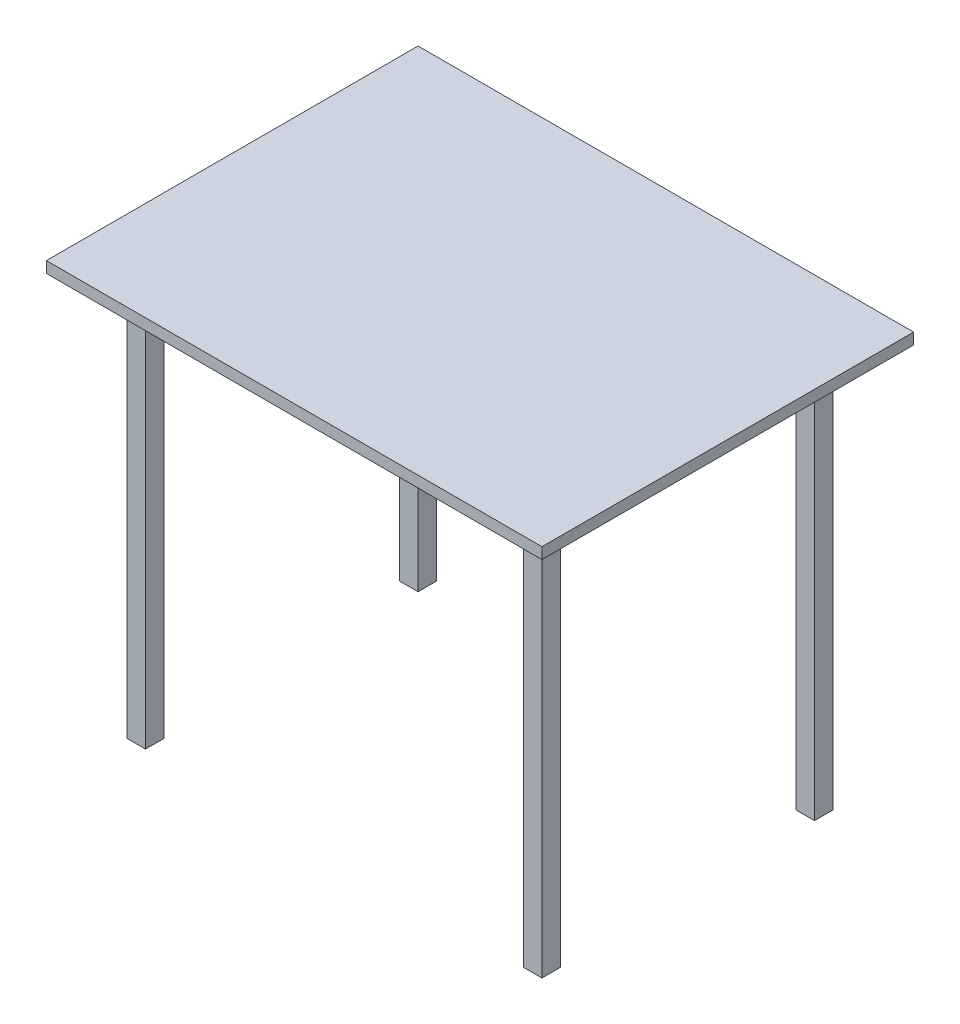
ISO-10303-21;
HEADER;
FILE_DESCRIPTION(('STEP AP214'),'2;1');
FILE_NAME('part.step','',(''),(''),'','','');
FILE_SCHEMA(('AUTOMOTIVE_DESIGN { 1 0 10303 214 1 1 1 1 }'));
ENDSEC;
DATA;
#1=APPLICATION_CONTEXT('core data for automotive mechanical design processes');
#2=APPLICATION_PROTOCOL_DEFINITION('international standard','automotive_design',2000,#1);
#3=PRODUCT_CONTEXT('',#1,'mechanical');
#4=PRODUCT('Part','Part','',(#3));
#5=PRODUCT_RELATED_PRODUCT_CATEGORY('part','',(#4));
#6=PRODUCT_DEFINITION_FORMATION('','',#4);
#7=PRODUCT_DEFINITION_CONTEXT('part definition',#1,'design');
#8=PRODUCT_DEFINITION('design','',#6,#7);
#9=PRODUCT_DEFINITION_SHAPE('','',#8);
#10=(LENGTH_UNIT() NAMED_UNIT(*) SI_UNIT(.MILLI.,.METRE.));
#11=(NAMED_UNIT(*) PLANE_ANGLE_UNIT() SI_UNIT($,.RADIAN.));
#12=(NAMED_UNIT(*) SI_UNIT($,.STERADIAN.) SOLID_ANGLE_UNIT());
#13=UNCERTAINTY_MEASURE_WITH_UNIT(LENGTH_MEASURE(1.E-05),#10,'distance_accuracy_value','');
#14=(GEOMETRIC_REPRESENTATION_CONTEXT(3) GLOBAL_UNCERTAINTY_ASSIGNED_CONTEXT((#13)) GLOBAL_UNIT_ASSIGNED_CONTEXT((#10,
#11,#12)) REPRESENTATION_CONTEXT('',''));
#15=CARTESIAN_POINT('',(0.,0.,0.));
#16=DIRECTION('',(0.,0.,1.));
#17=DIRECTION('',(1.,0.,0.));
#18=AXIS2_PLACEMENT_3D('',#15,#16,#17);
#19=CARTESIAN_POINT('',(0.,0.,0.));
#20=DIRECTION('',(0.,1.,0.));
#21=DIRECTION('',(0.,0.,1.));
#22=AXIS2_PLACEMENT_3D('',#19,#20,#21);
#23=PLANE('',#22);
#24=DIRECTION('',(0.,0.,-1.));
#25=VECTOR('',#24,1.);
#26=CARTESIAN_POINT('',(305.,0.,-205.));
#27=LINE('',#26,#25);
#28=CARTESIAN_POINT('',(305.,0.,-205.));
#29=VERTEX_POINT('',#28);
#30=CARTESIAN_POINT('',(305.,0.,-235.));
#31=VERTEX_POINT('',#30);
#32=EDGE_CURVE('E193',#29,#31,#27,.T.);
#33=ORIENTED_EDGE('',*,*,#32,.F.);
#34=DIRECTION('',(-1.,0.,0.));
#35=VECTOR('',#34,1.);
#36=CARTESIAN_POINT('',(335.,0.,-205.));
#37=LINE('',#36,#35);
#38=CARTESIAN_POINT('',(335.,0.,-205.));
#39=VERTEX_POINT('',#38);
#40=EDGE_CURVE('E206',#39,#29,#37,.T.);
#41=ORIENTED_EDGE('',*,*,#40,.F.);
#42=DIRECTION('',(0.,0.,1.));
#43=VECTOR('',#42,1.);
#44=CARTESIAN_POINT('',(335.,0.,-205.));
#45=LINE('',#44,#43);
#46=CARTESIAN_POINT('',(335.,0.,-235.));
#47=VERTEX_POINT('',#46);
#48=EDGE_CURVE('E215',#47,#39,#45,.T.);
#49=ORIENTED_EDGE('',*,*,#48,.F.);
#50=DIRECTION('',(1.,0.,0.));
#51=VECTOR('',#50,1.);
#52=CARTESIAN_POINT('',(335.,0.,-235.));
#53=LINE('',#52,#51);
#54=EDGE_CURVE('E196',#31,#47,#53,.T.);
#55=ORIENTED_EDGE('',*,*,#54,.F.);
#56=EDGE_LOOP('',(#33,#41,#49,#55));
#57=FACE_BOUND('',#56,.T.);
#58=DIRECTION('',(0.,0.,-1.));
#59=VECTOR('',#58,1.);
#60=CARTESIAN_POINT('',(-335.,0.,235.));
#61=LINE('',#60,#59);
#62=CARTESIAN_POINT('',(-335.,0.,235.));
#63=VERTEX_POINT('',#62);
#64=CARTESIAN_POINT('',(-335.,0.,205.));
#65=VERTEX_POINT('',#64);
#66=EDGE_CURVE('E264',#63,#65,#61,.T.);
#67=ORIENTED_EDGE('',*,*,#66,.F.);
#68=DIRECTION('',(-1.,0.,0.));
#69=VECTOR('',#68,1.);
#70=CARTESIAN_POINT('',(-305.,0.,235.));
#71=LINE('',#70,#69);
#72=CARTESIAN_POINT('',(-305.,0.,235.));
#73=VERTEX_POINT('',#72);
#74=EDGE_CURVE('E269',#73,#63,#71,.T.);
#75=ORIENTED_EDGE('',*,*,#74,.F.);
#76=DIRECTION('',(0.,0.,1.));
#77=VECTOR('',#76,1.);
#78=CARTESIAN_POINT('',(-305.,0.,235.));
#79=LINE('',#78,#77);
#80=CARTESIAN_POINT('',(-305.,0.,205.));
#81=VERTEX_POINT('',#80);
#82=EDGE_CURVE('E281',#81,#73,#79,.T.);
#83=ORIENTED_EDGE('',*,*,#82,.F.);
#84=DIRECTION('',(1.,0.,0.));
#85=VECTOR('',#84,1.);
#86=CARTESIAN_POINT('',(-305.,0.,205.));
#87=LINE('',#86,#85);
#88=EDGE_CURVE('E278',#65,#81,#87,.T.);
#89=ORIENTED_EDGE('',*,*,#88,.F.);
#90=EDGE_LOOP('',(#67,#75,#83,#89));
#91=FACE_BOUND('',#90,.T.);
#92=DIRECTION('',(0.,0.,1.));
#93=VECTOR('',#92,1.);
#94=CARTESIAN_POINT('',(-400.,0.,300.));
#95=LINE('',#94,#93);
#96=CARTESIAN_POINT('',(-400.,0.,-300.));
#97=VERTEX_POINT('',#96);
#98=CARTESIAN_POINT('',(-400.,0.,300.));
#99=VERTEX_POINT('',#98);
#100=EDGE_CURVE('E297',#97,#99,#95,.T.);
#101=ORIENTED_EDGE('',*,*,#100,.F.);
#102=DIRECTION('',(-1.,0.,0.));
#103=VECTOR('',#102,1.);
#104=CARTESIAN_POINT('',(400.,0.,-300.));
#105=LINE('',#104,#103);
#106=CARTESIAN_POINT('',(400.,0.,-300.));
#107=VERTEX_POINT('',#106);
#108=EDGE_CURVE('E302',#107,#97,#105,.T.);
#109=ORIENTED_EDGE('',*,*,#108,.F.);
#110=DIRECTION('',(0.,0.,-1.));
#111=VECTOR('',#110,1.);
#112=CARTESIAN_POINT('',(400.,0.,300.));
#113=LINE('',#112,#111);
#114=CARTESIAN_POINT('',(400.,0.,300.));
#115=VERTEX_POINT('',#114);
#116=EDGE_CURVE('E313',#115,#107,#113,.T.);
#117=ORIENTED_EDGE('',*,*,#116,.F.);
#118=DIRECTION('',(1.,0.,0.));
#119=VECTOR('',#118,1.);
#120=CARTESIAN_POINT('',(400.,0.,300.));
#121=LINE('',#120,#119);
#122=EDGE_CURVE('E311',#99,#115,#121,.T.);
#123=ORIENTED_EDGE('',*,*,#122,.F.);
#124=EDGE_LOOP('',(#101,#109,#117,#123));
#125=FACE_BOUND('',#124,.T.);
#126=DIRECTION('',(0.,0.,-1.));
#127=VECTOR('',#126,1.);
#128=CARTESIAN_POINT('',(305.,0.,235.));
#129=LINE('',#128,#127);
#130=CARTESIAN_POINT('',(305.,0.,235.));
#131=VERTEX_POINT('',#130);
#132=CARTESIAN_POINT('',(305.,0.,205.));
#133=VERTEX_POINT('',#132);
#134=EDGE_CURVE('E231',#131,#133,#129,.T.);
#135=ORIENTED_EDGE('',*,*,#134,.F.);
#136=DIRECTION('',(-1.,0.,0.));
#137=VECTOR('',#136,1.);
#138=CARTESIAN_POINT('',(335.,0.,235.));
#139=LINE('',#138,#137);
#140=CARTESIAN_POINT('',(335.,0.,235.));
#141=VERTEX_POINT('',#140);
#142=EDGE_CURVE('E236',#141,#131,#139,.T.);
#143=ORIENTED_EDGE('',*,*,#142,.F.);
#144=DIRECTION('',(0.,0.,1.));
#145=VECTOR('',#144,1.);
#146=CARTESIAN_POINT('',(335.,0.,235.));
#147=LINE('',#146,#145);
#148=CARTESIAN_POINT('',(335.,0.,205.));
#149=VERTEX_POINT('',#148);
#150=EDGE_CURVE('E248',#149,#141,#147,.T.);
#151=ORIENTED_EDGE('',*,*,#150,.F.);
#152=DIRECTION('',(1.,0.,0.));
#153=VECTOR('',#152,1.);
#154=CARTESIAN_POINT('',(335.,0.,205.));
#155=LINE('',#154,#153);
#156=EDGE_CURVE('E245',#133,#149,#155,.T.);
#157=ORIENTED_EDGE('',*,*,#156,.F.);
#158=EDGE_LOOP('',(#135,#143,#151,#157));
#159=FACE_BOUND('',#158,.T.);
#160=DIRECTION('',(0.,0.,-1.));
#161=VECTOR('',#160,1.);
#162=CARTESIAN_POINT('',(-335.,0.,-205.));
#163=LINE('',#162,#161);
#164=CARTESIAN_POINT('',(-335.,0.,-205.));
#165=VERTEX_POINT('',#164);
#166=CARTESIAN_POINT('',(-335.,0.,-235.));
#167=VERTEX_POINT('',#166);
#168=EDGE_CURVE('E192',#165,#167,#163,.T.);
#169=ORIENTED_EDGE('',*,*,#168,.F.);
#170=DIRECTION('',(-1.,0.,0.));
#171=VECTOR('',#170,1.);
#172=CARTESIAN_POINT('',(-305.,0.,-205.));
#173=LINE('',#172,#171);
#174=CARTESIAN_POINT('',(-305.,0.,-205.));
#175=VERTEX_POINT('',#174);
#176=EDGE_CURVE('E189',#175,#165,#173,.T.);
#177=ORIENTED_EDGE('',*,*,#176,.F.);
#178=DIRECTION('',(0.,0.,1.));
#179=VECTOR('',#178,1.);
#180=CARTESIAN_POINT('',(-305.,0.,-205.));
#181=LINE('',#180,#179);
#182=CARTESIAN_POINT('',(-305.,0.,-235.));
#183=VERTEX_POINT('',#182);
#184=EDGE_CURVE('E55',#183,#175,#181,.T.);
#185=ORIENTED_EDGE('',*,*,#184,.F.);
#186=DIRECTION('',(1.,0.,0.));
#187=VECTOR('',#186,1.);
#188=CARTESIAN_POINT('',(-305.,0.,-235.));
#189=LINE('',#188,#187);
#190=EDGE_CURVE('E50',#167,#183,#189,.T.);
#191=ORIENTED_EDGE('',*,*,#190,.F.);
#192=EDGE_LOOP('',(#169,#177,#185,#191));
#193=FACE_BOUND('',#192,.T.);
#194=ADVANCED_FACE('F35',(#57,#91,#125,#159,#193),#23,.F.);
#195=CARTESIAN_POINT('',(-400.,18.,300.));
#196=DIRECTION('',(1.,0.,0.));
#197=DIRECTION('',(0.,0.,-1.));
#198=AXIS2_PLACEMENT_3D('',#195,#196,#197);
#199=PLANE('',#198);
#200=ORIENTED_EDGE('',*,*,#100,.T.);
#201=DIRECTION('',(0.,-1.,0.));
#202=VECTOR('',#201,1.);
#203=CARTESIAN_POINT('',(-400.,18.,300.));
#204=LINE('',#203,#202);
#205=CARTESIAN_POINT('',(-400.,18.,300.));
#206=VERTEX_POINT('',#205);
#207=EDGE_CURVE('E11',#206,#99,#204,.T.);
#208=ORIENTED_EDGE('',*,*,#207,.F.);
#209=DIRECTION('',(0.,0.,1.));
#210=VECTOR('',#209,1.);
#211=CARTESIAN_POINT('',(-400.,18.,300.));
#212=LINE('',#211,#210);
#213=CARTESIAN_POINT('',(-400.,18.,-300.));
#214=VERTEX_POINT('',#213);
#215=EDGE_CURVE('E298',#214,#206,#212,.T.);
#216=ORIENTED_EDGE('',*,*,#215,.F.);
#217=DIRECTION('',(0.,-1.,0.));
#218=VECTOR('',#217,1.);
#219=CARTESIAN_POINT('',(-400.,18.,-300.));
#220=LINE('',#219,#218);
#221=EDGE_CURVE('E308',#214,#97,#220,.T.);
#222=ORIENTED_EDGE('',*,*,#221,.T.);
#223=EDGE_LOOP('',(#200,#208,#216,#222));
#224=FACE_BOUND('',#223,.T.);
#225=ADVANCED_FACE('F37',(#224),#199,.F.);
#226=CARTESIAN_POINT('',(400.,18.,300.));
#227=DIRECTION('',(0.,0.,-1.));
#228=DIRECTION('',(-1.,0.,0.));
#229=AXIS2_PLACEMENT_3D('',#226,#227,#228);
#230=PLANE('',#229);
#231=ORIENTED_EDGE('',*,*,#122,.T.);
#232=DIRECTION('',(0.,-1.,0.));
#233=VECTOR('',#232,1.);
#234=CARTESIAN_POINT('',(400.,18.,300.));
#235=LINE('',#234,#233);
#236=CARTESIAN_POINT('',(400.,18.,300.));
#237=VERTEX_POINT('',#236);
#238=EDGE_CURVE('E43',#237,#115,#235,.T.);
#239=ORIENTED_EDGE('',*,*,#238,.F.);
#240=DIRECTION('',(1.,0.,0.));
#241=VECTOR('',#240,1.);
#242=CARTESIAN_POINT('',(400.,18.,300.));
#243=LINE('',#242,#241);
#244=EDGE_CURVE('E301',#206,#237,#243,.T.);
#245=ORIENTED_EDGE('',*,*,#244,.F.);
#246=ORIENTED_EDGE('',*,*,#207,.T.);
#247=EDGE_LOOP('',(#231,#239,#245,#246));
#248=FACE_BOUND('',#247,.T.);
#249=ADVANCED_FACE('F341',(#248),#230,.F.);
#250=CARTESIAN_POINT('',(400.,18.,300.));
#251=DIRECTION('',(-1.,0.,0.));
#252=DIRECTION('',(0.,0.,1.));
#253=AXIS2_PLACEMENT_3D('',#250,#251,#252);
#254=PLANE('',#253);
#255=ORIENTED_EDGE('',*,*,#116,.T.);
#256=DIRECTION('',(0.,-1.,0.));
#257=VECTOR('',#256,1.);
#258=CARTESIAN_POINT('',(400.,18.,-300.));
#259=LINE('',#258,#257);
#260=CARTESIAN_POINT('',(400.,18.,-300.));
#261=VERTEX_POINT('',#260);
#262=EDGE_CURVE('E318',#261,#107,#259,.T.);
#263=ORIENTED_EDGE('',*,*,#262,.F.);
#264=DIRECTION('',(0.,0.,-1.));
#265=VECTOR('',#264,1.);
#266=CARTESIAN_POINT('',(400.,18.,300.));
#267=LINE('',#266,#265);
#268=EDGE_CURVE('E304',#237,#261,#267,.T.);
#269=ORIENTED_EDGE('',*,*,#268,.F.);
#270=ORIENTED_EDGE('',*,*,#238,.T.);
#271=EDGE_LOOP('',(#255,#263,#269,#270));
#272=FACE_BOUND('',#271,.T.);
#273=ADVANCED_FACE('F325',(#272),#254,.F.);
#274=CARTESIAN_POINT('',(400.,18.,-300.));
#275=DIRECTION('',(0.,0.,1.));
#276=DIRECTION('',(1.,0.,0.));
#277=AXIS2_PLACEMENT_3D('',#274,#275,#276);
#278=PLANE('',#277);
#279=ORIENTED_EDGE('',*,*,#108,.T.);
#280=ORIENTED_EDGE('',*,*,#221,.F.);
#281=DIRECTION('',(-1.,0.,0.));
#282=VECTOR('',#281,1.);
#283=CARTESIAN_POINT('',(400.,18.,-300.));
#284=LINE('',#283,#282);
#285=EDGE_CURVE('E306',#261,#214,#284,.T.);
#286=ORIENTED_EDGE('',*,*,#285,.F.);
#287=ORIENTED_EDGE('',*,*,#262,.T.);
#288=EDGE_LOOP('',(#279,#280,#286,#287));
#289=FACE_BOUND('',#288,.T.);
#290=ADVANCED_FACE('F334',(#289),#278,.F.);
#291=CARTESIAN_POINT('',(0.,18.,0.));
#292=DIRECTION('',(0.,1.,0.));
#293=DIRECTION('',(0.,0.,1.));
#294=AXIS2_PLACEMENT_3D('',#291,#292,#293);
#295=PLANE('',#294);
#296=ORIENTED_EDGE('',*,*,#215,.T.);
#297=ORIENTED_EDGE('',*,*,#244,.T.);
#298=ORIENTED_EDGE('',*,*,#268,.T.);
#299=ORIENTED_EDGE('',*,*,#285,.T.);
#300=EDGE_LOOP('',(#296,#297,#298,#299));
#301=FACE_BOUND('',#300,.T.);
#302=ADVANCED_FACE('F340',(#301),#295,.T.);
#303=CARTESIAN_POINT('',(-335.,-650.,235.));
#304=DIRECTION('',(1.,0.,0.));
#305=DIRECTION('',(0.,0.,-1.));
#306=AXIS2_PLACEMENT_3D('',#303,#304,#305);
#307=PLANE('',#306);
#308=ORIENTED_EDGE('',*,*,#66,.T.);
#309=DIRECTION('',(0.,1.,0.));
#310=VECTOR('',#309,1.);
#311=CARTESIAN_POINT('',(-335.,-650.,205.));
#312=LINE('',#311,#310);
#313=CARTESIAN_POINT('',(-335.,-650.,205.));
#314=VERTEX_POINT('',#313);
#315=EDGE_CURVE('E294',#314,#65,#312,.T.);
#316=ORIENTED_EDGE('',*,*,#315,.F.);
#317=DIRECTION('',(0.,0.,-1.));
#318=VECTOR('',#317,1.);
#319=CARTESIAN_POINT('',(-335.,-650.,235.));
#320=LINE('',#319,#318);
#321=CARTESIAN_POINT('',(-335.,-650.,235.));
#322=VERTEX_POINT('',#321);
#323=EDGE_CURVE('E265',#322,#314,#320,.T.);
#324=ORIENTED_EDGE('',*,*,#323,.F.);
#325=DIRECTION('',(0.,1.,0.));
#326=VECTOR('',#325,1.);
#327=CARTESIAN_POINT('',(-335.,-650.,235.));
#328=LINE('',#327,#326);
#329=EDGE_CURVE('E275',#322,#63,#328,.T.);
#330=ORIENTED_EDGE('',*,*,#329,.T.);
#331=EDGE_LOOP('',(#308,#316,#324,#330));
#332=FACE_BOUND('',#331,.T.);
#333=ADVANCED_FACE('F361',(#332),#307,.F.);
#334=CARTESIAN_POINT('',(-305.,-650.,205.));
#335=DIRECTION('',(0.,0.,1.));
#336=DIRECTION('',(1.,0.,0.));
#337=AXIS2_PLACEMENT_3D('',#334,#335,#336);
#338=PLANE('',#337);
#339=ORIENTED_EDGE('',*,*,#88,.T.);
#340=DIRECTION('',(0.,1.,0.));
#341=VECTOR('',#340,1.);
#342=CARTESIAN_POINT('',(-305.,-650.,205.));
#343=LINE('',#342,#341);
#344=CARTESIAN_POINT('',(-305.,-650.,205.));
#345=VERTEX_POINT('',#344);
#346=EDGE_CURVE('E291',#345,#81,#343,.T.);
#347=ORIENTED_EDGE('',*,*,#346,.F.);
#348=DIRECTION('',(1.,0.,0.));
#349=VECTOR('',#348,1.);
#350=CARTESIAN_POINT('',(-305.,-650.,205.));
#351=LINE('',#350,#349);
#352=EDGE_CURVE('E268',#314,#345,#351,.T.);
#353=ORIENTED_EDGE('',*,*,#352,.F.);
#354=ORIENTED_EDGE('',*,*,#315,.T.);
#355=EDGE_LOOP('',(#339,#347,#353,#354));
#356=FACE_BOUND('',#355,.T.);
#357=ADVANCED_FACE('F365',(#356),#338,.F.);
#358=CARTESIAN_POINT('',(-305.,-650.,235.));
#359=DIRECTION('',(-1.,0.,0.));
#360=DIRECTION('',(0.,0.,1.));
#361=AXIS2_PLACEMENT_3D('',#358,#359,#360);
#362=PLANE('',#361);
#363=ORIENTED_EDGE('',*,*,#82,.T.);
#364=DIRECTION('',(0.,1.,0.));
#365=VECTOR('',#364,1.);
#366=CARTESIAN_POINT('',(-305.,-650.,235.));
#367=LINE('',#366,#365);
#368=CARTESIAN_POINT('',(-305.,-650.,235.));
#369=VERTEX_POINT('',#368);
#370=EDGE_CURVE('E288',#369,#73,#367,.T.);
#371=ORIENTED_EDGE('',*,*,#370,.F.);
#372=DIRECTION('',(0.,0.,1.));
#373=VECTOR('',#372,1.);
#374=CARTESIAN_POINT('',(-305.,-650.,235.));
#375=LINE('',#374,#373);
#376=EDGE_CURVE('E271',#345,#369,#375,.T.);
#377=ORIENTED_EDGE('',*,*,#376,.F.);
#378=ORIENTED_EDGE('',*,*,#346,.T.);
#379=EDGE_LOOP('',(#363,#371,#377,#378));
#380=FACE_BOUND('',#379,.T.);
#381=ADVANCED_FACE('F370',(#380),#362,.F.);
#382=CARTESIAN_POINT('',(-305.,-650.,235.));
#383=DIRECTION('',(0.,0.,-1.));
#384=DIRECTION('',(-1.,0.,0.));
#385=AXIS2_PLACEMENT_3D('',#382,#383,#384);
#386=PLANE('',#385);
#387=ORIENTED_EDGE('',*,*,#74,.T.);
#388=ORIENTED_EDGE('',*,*,#329,.F.);
#389=DIRECTION('',(-1.,0.,0.));
#390=VECTOR('',#389,1.);
#391=CARTESIAN_POINT('',(-305.,-650.,235.));
#392=LINE('',#391,#390);
#393=EDGE_CURVE('E273',#369,#322,#392,.T.);
#394=ORIENTED_EDGE('',*,*,#393,.F.);
#395=ORIENTED_EDGE('',*,*,#370,.T.);
#396=EDGE_LOOP('',(#387,#388,#394,#395));
#397=FACE_BOUND('',#396,.T.);
#398=ADVANCED_FACE('F376',(#397),#386,.F.);
#399=CARTESIAN_POINT('',(0.,-650.,0.));
#400=DIRECTION('',(0.,1.,0.));
#401=DIRECTION('',(0.,0.,1.));
#402=AXIS2_PLACEMENT_3D('',#399,#400,#401);
#403=PLANE('',#402);
#404=ORIENTED_EDGE('',*,*,#323,.T.);
#405=ORIENTED_EDGE('',*,*,#352,.T.);
#406=ORIENTED_EDGE('',*,*,#376,.T.);
#407=ORIENTED_EDGE('',*,*,#393,.T.);
#408=EDGE_LOOP('',(#404,#405,#406,#407));
#409=FACE_BOUND('',#408,.T.);
#410=ADVANCED_FACE('F380',(#409),#403,.F.);
#411=CARTESIAN_POINT('',(305.,-650.,235.));
#412=DIRECTION('',(1.,0.,0.));
#413=DIRECTION('',(0.,0.,-1.));
#414=AXIS2_PLACEMENT_3D('',#411,#412,#413);
#415=PLANE('',#414);
#416=ORIENTED_EDGE('',*,*,#134,.T.);
#417=DIRECTION('',(0.,1.,0.));
#418=VECTOR('',#417,1.);
#419=CARTESIAN_POINT('',(305.,-650.,205.));
#420=LINE('',#419,#418);
#421=CARTESIAN_POINT('',(305.,-650.,205.));
#422=VERTEX_POINT('',#421);
#423=EDGE_CURVE('E261',#422,#133,#420,.T.);
#424=ORIENTED_EDGE('',*,*,#423,.F.);
#425=DIRECTION('',(0.,0.,-1.));
#426=VECTOR('',#425,1.);
#427=CARTESIAN_POINT('',(305.,-650.,235.));
#428=LINE('',#427,#426);
#429=CARTESIAN_POINT('',(305.,-650.,235.));
#430=VERTEX_POINT('',#429);
#431=EDGE_CURVE('E232',#430,#422,#428,.T.);
#432=ORIENTED_EDGE('',*,*,#431,.F.);
#433=DIRECTION('',(0.,1.,0.));
#434=VECTOR('',#433,1.);
#435=CARTESIAN_POINT('',(305.,-650.,235.));
#436=LINE('',#435,#434);
#437=EDGE_CURVE('E242',#430,#131,#436,.T.);
#438=ORIENTED_EDGE('',*,*,#437,.T.);
#439=EDGE_LOOP('',(#416,#424,#432,#438));
#440=FACE_BOUND('',#439,.T.);
#441=ADVANCED_FACE('F384',(#440),#415,.F.);
#442=CARTESIAN_POINT('',(335.,-650.,205.));
#443=DIRECTION('',(0.,0.,1.));
#444=DIRECTION('',(1.,0.,0.));
#445=AXIS2_PLACEMENT_3D('',#442,#443,#444);
#446=PLANE('',#445);
#447=ORIENTED_EDGE('',*,*,#156,.T.);
#448=DIRECTION('',(0.,1.,0.));
#449=VECTOR('',#448,1.);
#450=CARTESIAN_POINT('',(335.,-650.,205.));
#451=LINE('',#450,#449);
#452=CARTESIAN_POINT('',(335.,-650.,205.));
#453=VERTEX_POINT('',#452);
#454=EDGE_CURVE('E258',#453,#149,#451,.T.);
#455=ORIENTED_EDGE('',*,*,#454,.F.);
#456=DIRECTION('',(1.,0.,0.));
#457=VECTOR('',#456,1.);
#458=CARTESIAN_POINT('',(335.,-650.,205.));
#459=LINE('',#458,#457);
#460=EDGE_CURVE('E235',#422,#453,#459,.T.);
#461=ORIENTED_EDGE('',*,*,#460,.F.);
#462=ORIENTED_EDGE('',*,*,#423,.T.);
#463=EDGE_LOOP('',(#447,#455,#461,#462));
#464=FACE_BOUND('',#463,.T.);
#465=ADVANCED_FACE('F388',(#464),#446,.F.);
#466=CARTESIAN_POINT('',(335.,-650.,235.));
#467=DIRECTION('',(-1.,0.,0.));
#468=DIRECTION('',(0.,0.,1.));
#469=AXIS2_PLACEMENT_3D('',#466,#467,#468);
#470=PLANE('',#469);
#471=ORIENTED_EDGE('',*,*,#150,.T.);
#472=DIRECTION('',(0.,1.,0.));
#473=VECTOR('',#472,1.);
#474=CARTESIAN_POINT('',(335.,-650.,235.));
#475=LINE('',#474,#473);
#476=CARTESIAN_POINT('',(335.,-650.,235.));
#477=VERTEX_POINT('',#476);
#478=EDGE_CURVE('E255',#477,#141,#475,.T.);
#479=ORIENTED_EDGE('',*,*,#478,.F.);
#480=DIRECTION('',(0.,0.,1.));
#481=VECTOR('',#480,1.);
#482=CARTESIAN_POINT('',(335.,-650.,235.));
#483=LINE('',#482,#481);
#484=EDGE_CURVE('E238',#453,#477,#483,.T.);
#485=ORIENTED_EDGE('',*,*,#484,.F.);
#486=ORIENTED_EDGE('',*,*,#454,.T.);
#487=EDGE_LOOP('',(#471,#479,#485,#486));
#488=FACE_BOUND('',#487,.T.);
#489=ADVANCED_FACE('F392',(#488),#470,.F.);
#490=CARTESIAN_POINT('',(335.,-650.,235.));
#491=DIRECTION('',(0.,0.,-1.));
#492=DIRECTION('',(-1.,0.,0.));
#493=AXIS2_PLACEMENT_3D('',#490,#491,#492);
#494=PLANE('',#493);
#495=ORIENTED_EDGE('',*,*,#142,.T.);
#496=ORIENTED_EDGE('',*,*,#437,.F.);
#497=DIRECTION('',(-1.,0.,0.));
#498=VECTOR('',#497,1.);
#499=CARTESIAN_POINT('',(335.,-650.,235.));
#500=LINE('',#499,#498);
#501=EDGE_CURVE('E240',#477,#430,#500,.T.);
#502=ORIENTED_EDGE('',*,*,#501,.F.);
#503=ORIENTED_EDGE('',*,*,#478,.T.);
#504=EDGE_LOOP('',(#495,#496,#502,#503));
#505=FACE_BOUND('',#504,.T.);
#506=ADVANCED_FACE('F396',(#505),#494,.F.);
#507=CARTESIAN_POINT('',(0.,-650.,0.));
#508=DIRECTION('',(0.,1.,0.));
#509=DIRECTION('',(0.,0.,1.));
#510=AXIS2_PLACEMENT_3D('',#507,#508,#509);
#511=PLANE('',#510);
#512=ORIENTED_EDGE('',*,*,#431,.T.);
#513=ORIENTED_EDGE('',*,*,#460,.T.);
#514=ORIENTED_EDGE('',*,*,#484,.T.);
#515=ORIENTED_EDGE('',*,*,#501,.T.);
#516=EDGE_LOOP('',(#512,#513,#514,#515));
#517=FACE_BOUND('',#516,.T.);
#518=ADVANCED_FACE('F400',(#517),#511,.F.);
#519=CARTESIAN_POINT('',(305.,-650.,-205.));
#520=DIRECTION('',(1.,0.,0.));
#521=DIRECTION('',(0.,0.,-1.));
#522=AXIS2_PLACEMENT_3D('',#519,#520,#521);
#523=PLANE('',#522);
#524=ORIENTED_EDGE('',*,*,#32,.T.);
#525=DIRECTION('',(0.,1.,0.));
#526=VECTOR('',#525,1.);
#527=CARTESIAN_POINT('',(305.,-650.,-235.));
#528=LINE('',#527,#526);
#529=CARTESIAN_POINT('',(305.,-650.,-235.));
#530=VERTEX_POINT('',#529);
#531=EDGE_CURVE('E228',#530,#31,#528,.T.);
#532=ORIENTED_EDGE('',*,*,#531,.F.);
#533=DIRECTION('',(0.,0.,-1.));
#534=VECTOR('',#533,1.);
#535=CARTESIAN_POINT('',(305.,-650.,-205.));
#536=LINE('',#535,#534);
#537=CARTESIAN_POINT('',(305.,-650.,-205.));
#538=VERTEX_POINT('',#537);
#539=EDGE_CURVE('E202',#538,#530,#536,.T.);
#540=ORIENTED_EDGE('',*,*,#539,.F.);
#541=DIRECTION('',(0.,1.,0.));
#542=VECTOR('',#541,1.);
#543=CARTESIAN_POINT('',(305.,-650.,-205.));
#544=LINE('',#543,#542);
#545=EDGE_CURVE('E211',#538,#29,#544,.T.);
#546=ORIENTED_EDGE('',*,*,#545,.T.);
#547=EDGE_LOOP('',(#524,#532,#540,#546));
#548=FACE_BOUND('',#547,.T.);
#549=ADVANCED_FACE('F404',(#548),#523,.F.);
#550=CARTESIAN_POINT('',(335.,-650.,-235.));
#551=DIRECTION('',(0.,0.,1.));
#552=DIRECTION('',(1.,0.,0.));
#553=AXIS2_PLACEMENT_3D('',#550,#551,#552);
#554=PLANE('',#553);
#555=ORIENTED_EDGE('',*,*,#54,.T.);
#556=DIRECTION('',(0.,1.,0.));
#557=VECTOR('',#556,1.);
#558=CARTESIAN_POINT('',(335.,-650.,-235.));
#559=LINE('',#558,#557);
#560=CARTESIAN_POINT('',(335.,-650.,-235.));
#561=VERTEX_POINT('',#560);
#562=EDGE_CURVE('E225',#561,#47,#559,.T.);
#563=ORIENTED_EDGE('',*,*,#562,.F.);
#564=DIRECTION('',(1.,0.,0.));
#565=VECTOR('',#564,1.);
#566=CARTESIAN_POINT('',(335.,-650.,-235.));
#567=LINE('',#566,#565);
#568=EDGE_CURVE('E205',#530,#561,#567,.T.);
#569=ORIENTED_EDGE('',*,*,#568,.F.);
#570=ORIENTED_EDGE('',*,*,#531,.T.);
#571=EDGE_LOOP('',(#555,#563,#569,#570));
#572=FACE_BOUND('',#571,.T.);
#573=ADVANCED_FACE('F408',(#572),#554,.F.);
#574=CARTESIAN_POINT('',(335.,-650.,-205.));
#575=DIRECTION('',(-1.,0.,0.));
#576=DIRECTION('',(0.,0.,1.));
#577=AXIS2_PLACEMENT_3D('',#574,#575,#576);
#578=PLANE('',#577);
#579=ORIENTED_EDGE('',*,*,#48,.T.);
#580=DIRECTION('',(0.,1.,0.));
#581=VECTOR('',#580,1.);
#582=CARTESIAN_POINT('',(335.,-650.,-205.));
#583=LINE('',#582,#581);
#584=CARTESIAN_POINT('',(335.,-650.,-205.));
#585=VERTEX_POINT('',#584);
#586=EDGE_CURVE('E222',#585,#39,#583,.T.);
#587=ORIENTED_EDGE('',*,*,#586,.F.);
#588=DIRECTION('',(0.,0.,1.));
#589=VECTOR('',#588,1.);
#590=CARTESIAN_POINT('',(335.,-650.,-205.));
#591=LINE('',#590,#589);
#592=EDGE_CURVE('E208',#561,#585,#591,.T.);
#593=ORIENTED_EDGE('',*,*,#592,.F.);
#594=ORIENTED_EDGE('',*,*,#562,.T.);
#595=EDGE_LOOP('',(#579,#587,#593,#594));
#596=FACE_BOUND('',#595,.T.);
#597=ADVANCED_FACE('F412',(#596),#578,.F.);
#598=CARTESIAN_POINT('',(335.,-650.,-205.));
#599=DIRECTION('',(0.,0.,-1.));
#600=DIRECTION('',(-1.,0.,0.));
#601=AXIS2_PLACEMENT_3D('',#598,#599,#600);
#602=PLANE('',#601);
#603=ORIENTED_EDGE('',*,*,#40,.T.);
#604=ORIENTED_EDGE('',*,*,#545,.F.);
#605=DIRECTION('',(-1.,0.,0.));
#606=VECTOR('',#605,1.);
#607=CARTESIAN_POINT('',(335.,-650.,-205.));
#608=LINE('',#607,#606);
#609=EDGE_CURVE('E210',#585,#538,#608,.T.);
#610=ORIENTED_EDGE('',*,*,#609,.F.);
#611=ORIENTED_EDGE('',*,*,#586,.T.);
#612=EDGE_LOOP('',(#603,#604,#610,#611));
#613=FACE_BOUND('',#612,.T.);
#614=ADVANCED_FACE('F416',(#613),#602,.F.);
#615=CARTESIAN_POINT('',(0.,-650.,0.));
#616=DIRECTION('',(0.,1.,0.));
#617=DIRECTION('',(0.,0.,1.));
#618=AXIS2_PLACEMENT_3D('',#615,#616,#617);
#619=PLANE('',#618);
#620=ORIENTED_EDGE('',*,*,#539,.T.);
#621=ORIENTED_EDGE('',*,*,#568,.T.);
#622=ORIENTED_EDGE('',*,*,#592,.T.);
#623=ORIENTED_EDGE('',*,*,#609,.T.);
#624=EDGE_LOOP('',(#620,#621,#622,#623));
#625=FACE_BOUND('',#624,.T.);
#626=ADVANCED_FACE('F420',(#625),#619,.F.);
#627=CARTESIAN_POINT('',(-335.,-650.,-205.));
#628=DIRECTION('',(1.,0.,0.));
#629=DIRECTION('',(0.,0.,-1.));
#630=AXIS2_PLACEMENT_3D('',#627,#628,#629);
#631=PLANE('',#630);
#632=ORIENTED_EDGE('',*,*,#168,.T.);
#633=DIRECTION('',(0.,1.,0.));
#634=VECTOR('',#633,1.);
#635=CARTESIAN_POINT('',(-335.,-650.,-235.));
#636=LINE('',#635,#634);
#637=CARTESIAN_POINT('',(-335.,-650.,-235.));
#638=VERTEX_POINT('',#637);
#639=EDGE_CURVE('E173',#638,#167,#636,.T.);
#640=ORIENTED_EDGE('',*,*,#639,.F.);
#641=DIRECTION('',(0.,0.,-1.));
#642=VECTOR('',#641,1.);
#643=CARTESIAN_POINT('',(-335.,-650.,-205.));
#644=LINE('',#643,#642);
#645=CARTESIAN_POINT('',(-335.,-650.,-205.));
#646=VERTEX_POINT('',#645);
#647=EDGE_CURVE('E180',#646,#638,#644,.T.);
#648=ORIENTED_EDGE('',*,*,#647,.F.);
#649=DIRECTION('',(0.,1.,0.));
#650=VECTOR('',#649,1.);
#651=CARTESIAN_POINT('',(-335.,-650.,-205.));
#652=LINE('',#651,#650);
#653=EDGE_CURVE('E586',#646,#165,#652,.T.);
#654=ORIENTED_EDGE('',*,*,#653,.T.);
#655=EDGE_LOOP('',(#632,#640,#648,#654));
#656=FACE_BOUND('',#655,.T.);
#657=ADVANCED_FACE('F191',(#656),#631,.F.);
#658=CARTESIAN_POINT('',(-305.,-650.,-235.));
#659=DIRECTION('',(0.,0.,1.));
#660=DIRECTION('',(1.,0.,0.));
#661=AXIS2_PLACEMENT_3D('',#658,#659,#660);
#662=PLANE('',#661);
#663=ORIENTED_EDGE('',*,*,#190,.T.);
#664=DIRECTION('',(0.,1.,0.));
#665=VECTOR('',#664,1.);
#666=CARTESIAN_POINT('',(-305.,-650.,-235.));
#667=LINE('',#666,#665);
#668=CARTESIAN_POINT('',(-305.,-650.,-235.));
#669=VERTEX_POINT('',#668);
#670=EDGE_CURVE('E176',#669,#183,#667,.T.);
#671=ORIENTED_EDGE('',*,*,#670,.F.);
#672=DIRECTION('',(1.,0.,0.));
#673=VECTOR('',#672,1.);
#674=CARTESIAN_POINT('',(-305.,-650.,-235.));
#675=LINE('',#674,#673);
#676=EDGE_CURVE('E169',#638,#669,#675,.T.);
#677=ORIENTED_EDGE('',*,*,#676,.F.);
#678=ORIENTED_EDGE('',*,*,#639,.T.);
#679=EDGE_LOOP('',(#663,#671,#677,#678));
#680=FACE_BOUND('',#679,.T.);
#681=ADVANCED_FACE('F171',(#680),#662,.F.);
#682=CARTESIAN_POINT('',(-305.,-650.,-205.));
#683=DIRECTION('',(-1.,0.,0.));
#684=DIRECTION('',(0.,0.,1.));
#685=AXIS2_PLACEMENT_3D('',#682,#683,#684);
#686=PLANE('',#685);
#687=ORIENTED_EDGE('',*,*,#184,.T.);
#688=DIRECTION('',(0.,1.,0.));
#689=VECTOR('',#688,1.);
#690=CARTESIAN_POINT('',(-305.,-650.,-205.));
#691=LINE('',#690,#689);
#692=CARTESIAN_POINT('',(-305.,-650.,-205.));
#693=VERTEX_POINT('',#692);
#694=EDGE_CURVE('E198',#693,#175,#691,.T.);
#695=ORIENTED_EDGE('',*,*,#694,.F.);
#696=DIRECTION('',(0.,0.,1.));
#697=VECTOR('',#696,1.);
#698=CARTESIAN_POINT('',(-305.,-650.,-205.));
#699=LINE('',#698,#697);
#700=EDGE_CURVE('E179',#669,#693,#699,.T.);
#701=ORIENTED_EDGE('',*,*,#700,.F.);
#702=ORIENTED_EDGE('',*,*,#670,.T.);
#703=EDGE_LOOP('',(#687,#695,#701,#702));
#704=FACE_BOUND('',#703,.T.);
#705=ADVANCED_FACE('F429',(#704),#686,.F.);
#706=CARTESIAN_POINT('',(-305.,-650.,-205.));
#707=DIRECTION('',(0.,0.,-1.));
#708=DIRECTION('',(-1.,0.,0.));
#709=AXIS2_PLACEMENT_3D('',#706,#707,#708);
#710=PLANE('',#709);
#711=ORIENTED_EDGE('',*,*,#176,.T.);
#712=ORIENTED_EDGE('',*,*,#653,.F.);
#713=DIRECTION('',(-1.,0.,0.));
#714=VECTOR('',#713,1.);
#715=CARTESIAN_POINT('',(-305.,-650.,-205.));
#716=LINE('',#715,#714);
#717=EDGE_CURVE('E185',#693,#646,#716,.T.);
#718=ORIENTED_EDGE('',*,*,#717,.F.);
#719=ORIENTED_EDGE('',*,*,#694,.T.);
#720=EDGE_LOOP('',(#711,#712,#718,#719));
#721=FACE_BOUND('',#720,.T.);
#722=ADVANCED_FACE('F432',(#721),#710,.F.);
#723=CARTESIAN_POINT('',(0.,-650.,0.));
#724=DIRECTION('',(0.,1.,0.));
#725=DIRECTION('',(0.,0.,1.));
#726=AXIS2_PLACEMENT_3D('',#723,#724,#725);
#727=PLANE('',#726);
#728=ORIENTED_EDGE('',*,*,#647,.T.);
#729=ORIENTED_EDGE('',*,*,#676,.T.);
#730=ORIENTED_EDGE('',*,*,#700,.T.);
#731=ORIENTED_EDGE('',*,*,#717,.T.);
#732=EDGE_LOOP('',(#728,#729,#730,#731));
#733=FACE_BOUND('',#732,.T.);
#734=ADVANCED_FACE('F183',(#733),#727,.F.);
#735=CLOSED_SHELL('',(#194,#225,#249,#273,#290,#302,#333,#357,#381,#398,#410,#441,#465,#489,
#506,#518,#549,#573,#597,#614,#626,#657,#681,#705,#722,#734));
#736=MANIFOLD_SOLID_BREP('B2',#735);
#737=ADVANCED_BREP_SHAPE_REPRESENTATION('',(#18,#736),#14);
#738=SHAPE_DEFINITION_REPRESENTATION(#9,#737);
ENDSEC;
END-ISO-10303-21;
